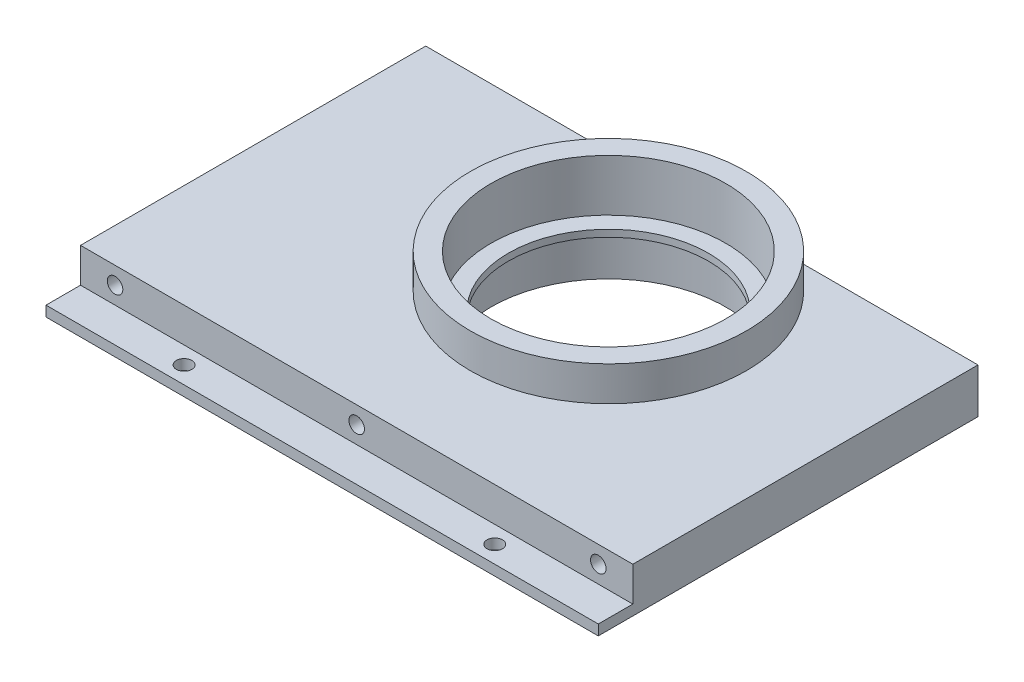
ISO-10303-21;
HEADER;
FILE_DESCRIPTION(('STEP AP214'),'2;1');
FILE_NAME('part.step','',(''),(''),'','','');
FILE_SCHEMA(('AUTOMOTIVE_DESIGN { 1 0 10303 214 1 1 1 1 }'));
ENDSEC;
DATA;
#1=APPLICATION_CONTEXT('core data for automotive mechanical design processes');
#2=APPLICATION_PROTOCOL_DEFINITION('international standard','automotive_design',2000,#1);
#3=PRODUCT_CONTEXT('',#1,'mechanical');
#4=PRODUCT('Part','Part','',(#3));
#5=PRODUCT_RELATED_PRODUCT_CATEGORY('part','',(#4));
#6=PRODUCT_DEFINITION_FORMATION('','',#4);
#7=PRODUCT_DEFINITION_CONTEXT('part definition',#1,'design');
#8=PRODUCT_DEFINITION('design','',#6,#7);
#9=PRODUCT_DEFINITION_SHAPE('','',#8);
#10=(LENGTH_UNIT() NAMED_UNIT(*) SI_UNIT(.MILLI.,.METRE.));
#11=(NAMED_UNIT(*) PLANE_ANGLE_UNIT() SI_UNIT($,.RADIAN.));
#12=(NAMED_UNIT(*) SI_UNIT($,.STERADIAN.) SOLID_ANGLE_UNIT());
#13=UNCERTAINTY_MEASURE_WITH_UNIT(LENGTH_MEASURE(1.E-05),#10,'distance_accuracy_value','');
#14=(GEOMETRIC_REPRESENTATION_CONTEXT(3) GLOBAL_UNCERTAINTY_ASSIGNED_CONTEXT((#13)) GLOBAL_UNIT_ASSIGNED_CONTEXT((#10,
#11,#12)) REPRESENTATION_CONTEXT('',''));
#15=CARTESIAN_POINT('',(0.,0.,0.));
#16=DIRECTION('',(0.,0.,1.));
#17=DIRECTION('',(1.,0.,0.));
#18=AXIS2_PLACEMENT_3D('',#15,#16,#17);
#19=CARTESIAN_POINT('',(0.,15.,0.));
#20=DIRECTION('',(0.,-1.,0.));
#21=DIRECTION('',(0.,0.,-1.));
#22=AXIS2_PLACEMENT_3D('',#19,#20,#21);
#23=CYLINDRICAL_SURFACE('',#22,40.);
#24=CARTESIAN_POINT('',(0.,-16.,0.));
#25=DIRECTION('',(0.,1.,0.));
#26=DIRECTION('',(0.,0.,1.));
#27=AXIS2_PLACEMENT_3D('',#24,#25,#26);
#28=CIRCLE('',#27,40.);
#29=CARTESIAN_POINT('',(0.,-16.,40.));
#30=VERTEX_POINT('',#29);
#31=EDGE_CURVE('E208',#30,#30,#28,.T.);
#32=ORIENTED_EDGE('',*,*,#31,.T.);
#33=EDGE_LOOP('',(#32));
#34=FACE_BOUND('',#33,.T.);
#35=CARTESIAN_POINT('',(0.,15.,0.));
#36=DIRECTION('',(0.,1.,0.));
#37=DIRECTION('',(0.,0.,1.));
#38=AXIS2_PLACEMENT_3D('',#35,#36,#37);
#39=CIRCLE('',#38,40.);
#40=CARTESIAN_POINT('',(0.,15.,40.));
#41=VERTEX_POINT('',#40);
#42=EDGE_CURVE('E47',#41,#41,#39,.T.);
#43=ORIENTED_EDGE('',*,*,#42,.F.);
#44=EDGE_LOOP('',(#43));
#45=FACE_BOUND('',#44,.T.);
#46=CARTESIAN_POINT('',(0.,-8.,0.));
#47=DIRECTION('',(0.,1.,0.));
#48=DIRECTION('',(0.,0.,1.));
#49=AXIS2_PLACEMENT_3D('',#46,#47,#48);
#50=CIRCLE('',#49,40.);
#51=CARTESIAN_POINT('',(-19.3649167310371,-8.,-35.));
#52=VERTEX_POINT('',#51);
#53=CARTESIAN_POINT('',(19.3649167310371,-8.,-35.));
#54=VERTEX_POINT('',#53);
#55=EDGE_CURVE('E135',#52,#54,#50,.T.);
#56=ORIENTED_EDGE('',*,*,#55,.F.);
#57=DIRECTION('',(0.,1.,0.));
#58=VECTOR('',#57,1.);
#59=CARTESIAN_POINT('',(-19.3649167310371,-5.,-35.));
#60=LINE('',#59,#58);
#61=CARTESIAN_POINT('',(-19.3649167310371,5.,-35.));
#62=VERTEX_POINT('',#61);
#63=EDGE_CURVE('E62',#52,#62,#60,.T.);
#64=ORIENTED_EDGE('',*,*,#63,.T.);
#65=CARTESIAN_POINT('',(0.,5.,0.));
#66=DIRECTION('',(0.,1.,0.));
#67=DIRECTION('',(0.,0.,1.));
#68=AXIS2_PLACEMENT_3D('',#65,#66,#67);
#69=CIRCLE('',#68,40.);
#70=CARTESIAN_POINT('',(19.3649167310371,5.,-35.));
#71=VERTEX_POINT('',#70);
#72=EDGE_CURVE('E165',#62,#71,#69,.T.);
#73=ORIENTED_EDGE('',*,*,#72,.T.);
#74=DIRECTION('',(0.,1.,0.));
#75=VECTOR('',#74,1.);
#76=CARTESIAN_POINT('',(19.3649167310371,-5.,-35.));
#77=LINE('',#76,#75);
#78=EDGE_CURVE('E54',#54,#71,#77,.T.);
#79=ORIENTED_EDGE('',*,*,#78,.F.);
#80=EDGE_LOOP('',(#56,#64,#73,#79));
#81=FACE_BOUND('',#80,.T.);
#82=ADVANCED_FACE('F39',(#34,#45,#81),#23,.T.);
#83=CARTESIAN_POINT('',(0.,15.,0.));
#84=DIRECTION('',(0.,-1.,0.));
#85=DIRECTION('',(0.,0.,-1.));
#86=AXIS2_PLACEMENT_3D('',#83,#84,#85);
#87=CYLINDRICAL_SURFACE('',#86,34.);
#88=CARTESIAN_POINT('',(0.,-16.,0.));
#89=DIRECTION('',(0.,1.,0.));
#90=DIRECTION('',(0.,0.,1.));
#91=AXIS2_PLACEMENT_3D('',#88,#89,#90);
#92=CIRCLE('',#91,34.);
#93=CARTESIAN_POINT('',(0.,-16.,34.));
#94=VERTEX_POINT('',#93);
#95=EDGE_CURVE('E203',#94,#94,#92,.T.);
#96=ORIENTED_EDGE('',*,*,#95,.F.);
#97=EDGE_LOOP('',(#96));
#98=FACE_BOUND('',#97,.T.);
#99=CARTESIAN_POINT('',(0.,-2.,0.));
#100=DIRECTION('',(0.,1.,0.));
#101=DIRECTION('',(0.,0.,1.));
#102=AXIS2_PLACEMENT_3D('',#99,#100,#101);
#103=CIRCLE('',#102,34.);
#104=CARTESIAN_POINT('',(0.,-2.,34.));
#105=VERTEX_POINT('',#104);
#106=EDGE_CURVE('E200',#105,#105,#103,.T.);
#107=ORIENTED_EDGE('',*,*,#106,.T.);
#108=EDGE_LOOP('',(#107));
#109=FACE_BOUND('',#108,.T.);
#110=ADVANCED_FACE('F219',(#98,#109),#87,.F.);
#111=CARTESIAN_POINT('',(0.,0.,0.));
#112=DIRECTION('',(0.,1.,0.));
#113=DIRECTION('',(0.,0.,1.));
#114=AXIS2_PLACEMENT_3D('',#111,#112,#113);
#115=CIRCLE('',#114,34.);
#116=CARTESIAN_POINT('',(0.,0.,34.));
#117=VERTEX_POINT('',#116);
#118=EDGE_CURVE('E11',#117,#117,#115,.T.);
#119=ORIENTED_EDGE('',*,*,#118,.F.);
#120=EDGE_LOOP('',(#119));
#121=FACE_BOUND('',#120,.T.);
#122=CARTESIAN_POINT('',(0.,15.,0.));
#123=DIRECTION('',(0.,1.,0.));
#124=DIRECTION('',(0.,0.,1.));
#125=AXIS2_PLACEMENT_3D('',#122,#123,#124);
#126=CIRCLE('',#125,34.);
#127=CARTESIAN_POINT('',(0.,15.,34.));
#128=VERTEX_POINT('',#127);
#129=EDGE_CURVE('E211',#128,#128,#126,.T.);
#130=ORIENTED_EDGE('',*,*,#129,.T.);
#131=EDGE_LOOP('',(#130));
#132=FACE_BOUND('',#131,.T.);
#133=ADVANCED_FACE('F41',(#121,#132),#87,.F.);
#134=CARTESIAN_POINT('',(0.,15.,0.));
#135=DIRECTION('',(0.,1.,0.));
#136=DIRECTION('',(0.,0.,1.));
#137=AXIS2_PLACEMENT_3D('',#134,#135,#136);
#138=PLANE('',#137);
#139=ORIENTED_EDGE('',*,*,#129,.F.);
#140=EDGE_LOOP('',(#139));
#141=FACE_BOUND('',#140,.T.);
#142=ORIENTED_EDGE('',*,*,#42,.T.);
#143=EDGE_LOOP('',(#142));
#144=FACE_BOUND('',#143,.T.);
#145=ADVANCED_FACE('F216',(#141,#144),#138,.T.);
#146=CARTESIAN_POINT('',(0.,-16.,0.));
#147=DIRECTION('',(0.,1.,0.));
#148=DIRECTION('',(0.,0.,1.));
#149=AXIS2_PLACEMENT_3D('',#146,#147,#148);
#150=PLANE('',#149);
#151=ORIENTED_EDGE('',*,*,#95,.T.);
#152=EDGE_LOOP('',(#151));
#153=FACE_BOUND('',#152,.T.);
#154=ORIENTED_EDGE('',*,*,#31,.F.);
#155=EDGE_LOOP('',(#154));
#156=FACE_BOUND('',#155,.T.);
#157=ADVANCED_FACE('F264',(#153,#156),#150,.F.);
#158=CARTESIAN_POINT('',(0.,-2.,0.));
#159=DIRECTION('',(0.,1.,0.));
#160=DIRECTION('',(0.,0.,1.));
#161=AXIS2_PLACEMENT_3D('',#158,#159,#160);
#162=CYLINDRICAL_SURFACE('',#161,29.);
#163=CARTESIAN_POINT('',(0.,-2.,0.));
#164=DIRECTION('',(0.,1.,0.));
#165=DIRECTION('',(0.,0.,1.));
#166=AXIS2_PLACEMENT_3D('',#163,#164,#165);
#167=CIRCLE('',#166,29.);
#168=CARTESIAN_POINT('',(0.,-2.,29.));
#169=VERTEX_POINT('',#168);
#170=EDGE_CURVE('E197',#169,#169,#167,.T.);
#171=ORIENTED_EDGE('',*,*,#170,.F.);
#172=EDGE_LOOP('',(#171));
#173=FACE_BOUND('',#172,.T.);
#174=CARTESIAN_POINT('',(0.,0.,0.));
#175=DIRECTION('',(0.,1.,0.));
#176=DIRECTION('',(0.,0.,1.));
#177=AXIS2_PLACEMENT_3D('',#174,#175,#176);
#178=CIRCLE('',#177,29.);
#179=CARTESIAN_POINT('',(0.,0.,29.));
#180=VERTEX_POINT('',#179);
#181=EDGE_CURVE('E187',#180,#180,#178,.T.);
#182=ORIENTED_EDGE('',*,*,#181,.T.);
#183=EDGE_LOOP('',(#182));
#184=FACE_BOUND('',#183,.T.);
#185=ADVANCED_FACE('F257',(#173,#184),#162,.F.);
#186=CARTESIAN_POINT('',(0.,-2.,0.));
#187=DIRECTION('',(0.,1.,0.));
#188=DIRECTION('',(0.,0.,1.));
#189=AXIS2_PLACEMENT_3D('',#186,#187,#188);
#190=PLANE('',#189);
#191=ORIENTED_EDGE('',*,*,#170,.T.);
#192=EDGE_LOOP('',(#191));
#193=FACE_BOUND('',#192,.T.);
#194=ORIENTED_EDGE('',*,*,#106,.F.);
#195=EDGE_LOOP('',(#194));
#196=FACE_BOUND('',#195,.T.);
#197=ADVANCED_FACE('F253',(#193,#196),#190,.F.);
#198=CARTESIAN_POINT('',(0.,0.,0.));
#199=DIRECTION('',(0.,1.,0.));
#200=DIRECTION('',(0.,0.,1.));
#201=AXIS2_PLACEMENT_3D('',#198,#199,#200);
#202=PLANE('',#201);
#203=ORIENTED_EDGE('',*,*,#181,.F.);
#204=EDGE_LOOP('',(#203));
#205=FACE_BOUND('',#204,.T.);
#206=ORIENTED_EDGE('',*,*,#118,.T.);
#207=EDGE_LOOP('',(#206));
#208=FACE_BOUND('',#207,.T.);
#209=ADVANCED_FACE('F256',(#205,#208),#202,.T.);
#210=CARTESIAN_POINT('',(0.,-5.,-35.));
#211=DIRECTION('',(0.,0.,1.));
#212=DIRECTION('',(1.,0.,0.));
#213=AXIS2_PLACEMENT_3D('',#210,#211,#212);
#214=PLANE('',#213);
#215=ORIENTED_EDGE('',*,*,#78,.T.);
#216=DIRECTION('',(1.,0.,0.));
#217=VECTOR('',#216,1.);
#218=CARTESIAN_POINT('',(0.,5.,-35.));
#219=LINE('',#218,#217);
#220=CARTESIAN_POINT('',(72.08,5.,-35.));
#221=VERTEX_POINT('',#220);
#222=EDGE_CURVE('E180',#71,#221,#219,.T.);
#223=ORIENTED_EDGE('',*,*,#222,.T.);
#224=DIRECTION('',(0.,1.,0.));
#225=VECTOR('',#224,1.);
#226=CARTESIAN_POINT('',(72.08,-5.,-35.));
#227=LINE('',#226,#225);
#228=CARTESIAN_POINT('',(72.08,-8.,-35.));
#229=VERTEX_POINT('',#228);
#230=EDGE_CURVE('E188',#229,#221,#227,.T.);
#231=ORIENTED_EDGE('',*,*,#230,.F.);
#232=DIRECTION('',(-1.,0.,0.));
#233=VECTOR('',#232,1.);
#234=CARTESIAN_POINT('',(0.,-8.,-34.9999999999999));
#235=LINE('',#234,#233);
#236=EDGE_CURVE('E133',#229,#54,#235,.T.);
#237=ORIENTED_EDGE('',*,*,#236,.T.);
#238=EDGE_LOOP('',(#215,#223,#231,#237));
#239=FACE_BOUND('',#238,.T.);
#240=ADVANCED_FACE('F233',(#239),#214,.F.);
#241=CARTESIAN_POINT('',(72.08,-5.,0.));
#242=DIRECTION('',(-1.,0.,0.));
#243=DIRECTION('',(0.,0.,1.));
#244=AXIS2_PLACEMENT_3D('',#241,#242,#243);
#245=PLANE('',#244);
#246=ORIENTED_EDGE('',*,*,#230,.T.);
#247=DIRECTION('',(0.,0.,1.));
#248=VECTOR('',#247,1.);
#249=CARTESIAN_POINT('',(72.08,5.,0.));
#250=LINE('',#249,#248);
#251=CARTESIAN_POINT('',(72.08,5.,65.));
#252=VERTEX_POINT('',#251);
#253=EDGE_CURVE('E177',#221,#252,#250,.T.);
#254=ORIENTED_EDGE('',*,*,#253,.T.);
#255=DIRECTION('',(0.,1.,0.));
#256=VECTOR('',#255,1.);
#257=CARTESIAN_POINT('',(72.08,-5.,65.));
#258=LINE('',#257,#256);
#259=CARTESIAN_POINT('',(72.08,-5.,65.));
#260=VERTEX_POINT('',#259);
#261=EDGE_CURVE('E190',#260,#252,#258,.T.);
#262=ORIENTED_EDGE('',*,*,#261,.F.);
#263=DIRECTION('',(0.,0.,-1.));
#264=VECTOR('',#263,1.);
#265=CARTESIAN_POINT('',(72.08,-5.,0.));
#266=LINE('',#265,#264);
#267=CARTESIAN_POINT('',(72.08,-5.,75.));
#268=VERTEX_POINT('',#267);
#269=EDGE_CURVE('E126',#268,#260,#266,.T.);
#270=ORIENTED_EDGE('',*,*,#269,.F.);
#271=DIRECTION('',(0.,1.,0.));
#272=VECTOR('',#271,1.);
#273=CARTESIAN_POINT('',(72.08,-8.,75.));
#274=LINE('',#273,#272);
#275=CARTESIAN_POINT('',(72.08,-8.,75.));
#276=VERTEX_POINT('',#275);
#277=EDGE_CURVE('E110',#276,#268,#274,.T.);
#278=ORIENTED_EDGE('',*,*,#277,.F.);
#279=DIRECTION('',(0.,0.,-1.));
#280=VECTOR('',#279,1.);
#281=CARTESIAN_POINT('',(72.08,-8.,0.));
#282=LINE('',#281,#280);
#283=EDGE_CURVE('E118',#276,#229,#282,.T.);
#284=ORIENTED_EDGE('',*,*,#283,.T.);
#285=EDGE_LOOP('',(#246,#254,#262,#270,#278,#284));
#286=FACE_BOUND('',#285,.T.);
#287=ADVANCED_FACE('F123',(#286),#245,.F.);
#288=CARTESIAN_POINT('',(-1.80411241501588E-13,-5.,65.0000000000002));
#289=DIRECTION('',(0.,0.,-1.));
#290=DIRECTION('',(-1.,0.,0.));
#291=AXIS2_PLACEMENT_3D('',#288,#289,#290);
#292=PLANE('',#291);
#293=CARTESIAN_POINT('',(62.0799999999997,0.,65.0000000000002));
#294=DIRECTION('',(0.,0.,1.));
#295=DIRECTION('',(-1.,0.,0.));
#296=AXIS2_PLACEMENT_3D('',#293,#294,#295);
#297=CIRCLE('',#296,2.25);
#298=CARTESIAN_POINT('',(59.8299999999997,0.,65.0000000000002));
#299=VERTEX_POINT('',#298);
#300=EDGE_CURVE('E148',#299,#299,#297,.T.);
#301=ORIENTED_EDGE('',*,*,#300,.F.);
#302=EDGE_LOOP('',(#301));
#303=FACE_BOUND('',#302,.T.);
#304=CARTESIAN_POINT('',(-77.9209924354783,0.,65.0000000000002));
#305=DIRECTION('',(0.,0.,1.));
#306=DIRECTION('',(1.,0.,0.));
#307=AXIS2_PLACEMENT_3D('',#304,#305,#306);
#308=CIRCLE('',#307,2.25);
#309=CARTESIAN_POINT('',(-75.6709924354783,0.,65.0000000000002));
#310=VERTEX_POINT('',#309);
#311=EDGE_CURVE('E154',#310,#310,#308,.T.);
#312=ORIENTED_EDGE('',*,*,#311,.F.);
#313=EDGE_LOOP('',(#312));
#314=FACE_BOUND('',#313,.T.);
#315=CARTESIAN_POINT('',(-7.92049621773916,0.,65.0000000000002));
#316=DIRECTION('',(0.,0.,1.));
#317=DIRECTION('',(1.,0.,0.));
#318=AXIS2_PLACEMENT_3D('',#315,#316,#317);
#319=CIRCLE('',#318,2.25);
#320=CARTESIAN_POINT('',(-5.67049621773916,0.,65.0000000000002));
#321=VERTEX_POINT('',#320);
#322=EDGE_CURVE('E153',#321,#321,#319,.T.);
#323=ORIENTED_EDGE('',*,*,#322,.F.);
#324=EDGE_LOOP('',(#323));
#325=FACE_BOUND('',#324,.T.);
#326=ORIENTED_EDGE('',*,*,#261,.T.);
#327=DIRECTION('',(-1.,0.,0.));
#328=VECTOR('',#327,1.);
#329=CARTESIAN_POINT('',(-1.80411241501588E-13,5.,65.0000000000002));
#330=LINE('',#329,#328);
#331=CARTESIAN_POINT('',(-87.9209924354783,5.,65.));
#332=VERTEX_POINT('',#331);
#333=EDGE_CURVE('E174',#252,#332,#330,.T.);
#334=ORIENTED_EDGE('',*,*,#333,.T.);
#335=DIRECTION('',(0.,1.,0.));
#336=VECTOR('',#335,1.);
#337=CARTESIAN_POINT('',(-87.9209924354783,-5.,65.));
#338=LINE('',#337,#336);
#339=CARTESIAN_POINT('',(-87.9209924354783,-5.,65.));
#340=VERTEX_POINT('',#339);
#341=EDGE_CURVE('E192',#340,#332,#338,.T.);
#342=ORIENTED_EDGE('',*,*,#341,.F.);
#343=DIRECTION('',(-1.,0.,0.));
#344=VECTOR('',#343,1.);
#345=CARTESIAN_POINT('',(-1.80411241501588E-13,-5.,65.0000000000002));
#346=LINE('',#345,#344);
#347=EDGE_CURVE('E183',#260,#340,#346,.T.);
#348=ORIENTED_EDGE('',*,*,#347,.F.);
#349=EDGE_LOOP('',(#326,#334,#342,#348));
#350=FACE_BOUND('',#349,.T.);
#351=ADVANCED_FACE('F237',(#303,#314,#325,#350),#292,.F.);
#352=CARTESIAN_POINT('',(-87.9209924354783,-5.,0.));
#353=DIRECTION('',(-1.,0.,0.));
#354=DIRECTION('',(0.,0.,1.));
#355=AXIS2_PLACEMENT_3D('',#352,#353,#354);
#356=PLANE('',#355);
#357=ORIENTED_EDGE('',*,*,#341,.T.);
#358=DIRECTION('',(0.,0.,1.));
#359=VECTOR('',#358,1.);
#360=CARTESIAN_POINT('',(-87.9209924354783,5.,0.));
#361=LINE('',#360,#359);
#362=CARTESIAN_POINT('',(-87.9209924354783,5.,-35.));
#363=VERTEX_POINT('',#362);
#364=EDGE_CURVE('E171',#363,#332,#361,.T.);
#365=ORIENTED_EDGE('',*,*,#364,.F.);
#366=DIRECTION('',(0.,1.,0.));
#367=VECTOR('',#366,1.);
#368=CARTESIAN_POINT('',(-87.9209924354783,-5.,-35.));
#369=LINE('',#368,#367);
#370=CARTESIAN_POINT('',(-87.9209924354783,-8.,-35.));
#371=VERTEX_POINT('',#370);
#372=EDGE_CURVE('E194',#371,#363,#369,.T.);
#373=ORIENTED_EDGE('',*,*,#372,.F.);
#374=DIRECTION('',(0.,0.,1.));
#375=VECTOR('',#374,1.);
#376=CARTESIAN_POINT('',(-87.9209924354783,-8.,0.));
#377=LINE('',#376,#375);
#378=CARTESIAN_POINT('',(-87.9209924354783,-8.,75.));
#379=VERTEX_POINT('',#378);
#380=EDGE_CURVE('E128',#371,#379,#377,.T.);
#381=ORIENTED_EDGE('',*,*,#380,.T.);
#382=DIRECTION('',(0.,1.,0.));
#383=VECTOR('',#382,1.);
#384=CARTESIAN_POINT('',(-87.9209924354783,-8.,75.));
#385=LINE('',#384,#383);
#386=CARTESIAN_POINT('',(-87.9209924354783,-5.,75.));
#387=VERTEX_POINT('',#386);
#388=EDGE_CURVE('E113',#379,#387,#385,.T.);
#389=ORIENTED_EDGE('',*,*,#388,.T.);
#390=DIRECTION('',(0.,0.,1.));
#391=VECTOR('',#390,1.);
#392=CARTESIAN_POINT('',(-87.9209924354783,-5.,0.));
#393=LINE('',#392,#391);
#394=EDGE_CURVE('E119',#340,#387,#393,.T.);
#395=ORIENTED_EDGE('',*,*,#394,.F.);
#396=EDGE_LOOP('',(#357,#365,#373,#381,#389,#395));
#397=FACE_BOUND('',#396,.T.);
#398=ADVANCED_FACE('F226',(#397),#356,.T.);
#399=CARTESIAN_POINT('',(0.,-5.,-35.));
#400=DIRECTION('',(0.,0.,1.));
#401=DIRECTION('',(1.,0.,0.));
#402=AXIS2_PLACEMENT_3D('',#399,#400,#401);
#403=PLANE('',#402);
#404=ORIENTED_EDGE('',*,*,#372,.T.);
#405=DIRECTION('',(1.,0.,0.));
#406=VECTOR('',#405,1.);
#407=CARTESIAN_POINT('',(0.,5.,-35.));
#408=LINE('',#407,#406);
#409=EDGE_CURVE('E169',#363,#62,#408,.T.);
#410=ORIENTED_EDGE('',*,*,#409,.T.);
#411=ORIENTED_EDGE('',*,*,#63,.F.);
#412=DIRECTION('',(-1.,0.,0.));
#413=VECTOR('',#412,1.);
#414=CARTESIAN_POINT('',(0.,-8.,-35.));
#415=LINE('',#414,#413);
#416=EDGE_CURVE('E140',#52,#371,#415,.T.);
#417=ORIENTED_EDGE('',*,*,#416,.T.);
#418=EDGE_LOOP('',(#404,#410,#411,#417));
#419=FACE_BOUND('',#418,.T.);
#420=ADVANCED_FACE('F222',(#419),#403,.F.);
#421=CARTESIAN_POINT('',(0.,5.,0.));
#422=DIRECTION('',(0.,1.,0.));
#423=DIRECTION('',(0.,0.,1.));
#424=AXIS2_PLACEMENT_3D('',#421,#422,#423);
#425=PLANE('',#424);
#426=ORIENTED_EDGE('',*,*,#72,.F.);
#427=ORIENTED_EDGE('',*,*,#409,.F.);
#428=ORIENTED_EDGE('',*,*,#364,.T.);
#429=ORIENTED_EDGE('',*,*,#333,.F.);
#430=ORIENTED_EDGE('',*,*,#253,.F.);
#431=ORIENTED_EDGE('',*,*,#222,.F.);
#432=EDGE_LOOP('',(#426,#427,#428,#429,#430,#431));
#433=FACE_BOUND('',#432,.T.);
#434=ADVANCED_FACE('F230',(#433),#425,.T.);
#435=CARTESIAN_POINT('',(-7.92049621773916,0.,55.0000000000002));
#436=DIRECTION('',(0.,0.,1.));
#437=DIRECTION('',(1.,0.,0.));
#438=AXIS2_PLACEMENT_3D('',#435,#436,#437);
#439=CYLINDRICAL_SURFACE('',#438,2.25);
#440=CARTESIAN_POINT('',(-7.92049621773916,0.,55.0000000000002));
#441=DIRECTION('',(0.,0.,1.));
#442=DIRECTION('',(1.,0.,0.));
#443=AXIS2_PLACEMENT_3D('',#440,#441,#442);
#444=CIRCLE('',#443,2.25);
#445=CARTESIAN_POINT('',(-5.67049621773916,0.,55.0000000000002));
#446=VERTEX_POINT('',#445);
#447=EDGE_CURVE('E162',#446,#446,#444,.T.);
#448=ORIENTED_EDGE('',*,*,#447,.F.);
#449=EDGE_LOOP('',(#448));
#450=FACE_BOUND('',#449,.T.);
#451=ORIENTED_EDGE('',*,*,#322,.T.);
#452=EDGE_LOOP('',(#451));
#453=FACE_BOUND('',#452,.T.);
#454=ADVANCED_FACE('F411',(#450,#453),#439,.F.);
#455=CARTESIAN_POINT('',(-7.92049621773916,0.,55.0000000000002));
#456=DIRECTION('',(0.,0.,1.));
#457=DIRECTION('',(1.,0.,0.));
#458=AXIS2_PLACEMENT_3D('',#455,#456,#457);
#459=PLANE('',#458);
#460=ORIENTED_EDGE('',*,*,#447,.T.);
#461=EDGE_LOOP('',(#460));
#462=FACE_BOUND('',#461,.T.);
#463=ADVANCED_FACE('F402',(#462),#459,.T.);
#464=CARTESIAN_POINT('',(-77.9209924354783,0.,55.0000000000002));
#465=DIRECTION('',(0.,0.,1.));
#466=DIRECTION('',(1.,0.,0.));
#467=AXIS2_PLACEMENT_3D('',#464,#465,#466);
#468=CYLINDRICAL_SURFACE('',#467,2.25);
#469=CARTESIAN_POINT('',(-77.9209924354783,0.,55.0000000000002));
#470=DIRECTION('',(0.,0.,1.));
#471=DIRECTION('',(1.,0.,0.));
#472=AXIS2_PLACEMENT_3D('',#469,#470,#471);
#473=CIRCLE('',#472,2.25);
#474=CARTESIAN_POINT('',(-75.6709924354783,0.,55.0000000000002));
#475=VERTEX_POINT('',#474);
#476=EDGE_CURVE('E150',#475,#475,#473,.T.);
#477=ORIENTED_EDGE('',*,*,#476,.F.);
#478=EDGE_LOOP('',(#477));
#479=FACE_BOUND('',#478,.T.);
#480=ORIENTED_EDGE('',*,*,#311,.T.);
#481=EDGE_LOOP('',(#480));
#482=FACE_BOUND('',#481,.T.);
#483=ADVANCED_FACE('F398',(#479,#482),#468,.F.);
#484=CARTESIAN_POINT('',(-77.9209924354783,0.,55.0000000000002));
#485=DIRECTION('',(0.,0.,1.));
#486=DIRECTION('',(1.,0.,0.));
#487=AXIS2_PLACEMENT_3D('',#484,#485,#486);
#488=PLANE('',#487);
#489=ORIENTED_EDGE('',*,*,#476,.T.);
#490=EDGE_LOOP('',(#489));
#491=FACE_BOUND('',#490,.T.);
#492=ADVANCED_FACE('F394',(#491),#488,.T.);
#493=CARTESIAN_POINT('',(62.0799999999997,0.,55.0000000000002));
#494=DIRECTION('',(0.,0.,1.));
#495=DIRECTION('',(1.,0.,0.));
#496=AXIS2_PLACEMENT_3D('',#493,#494,#495);
#497=CYLINDRICAL_SURFACE('',#496,2.25);
#498=CARTESIAN_POINT('',(62.0799999999997,0.,55.0000000000002));
#499=DIRECTION('',(0.,0.,1.));
#500=DIRECTION('',(-1.,0.,0.));
#501=AXIS2_PLACEMENT_3D('',#498,#499,#500);
#502=CIRCLE('',#501,2.25);
#503=CARTESIAN_POINT('',(59.8299999999997,0.,55.0000000000002));
#504=VERTEX_POINT('',#503);
#505=EDGE_CURVE('E157',#504,#504,#502,.T.);
#506=ORIENTED_EDGE('',*,*,#505,.F.);
#507=EDGE_LOOP('',(#506));
#508=FACE_BOUND('',#507,.T.);
#509=ORIENTED_EDGE('',*,*,#300,.T.);
#510=EDGE_LOOP('',(#509));
#511=FACE_BOUND('',#510,.T.);
#512=ADVANCED_FACE('F397',(#508,#511),#497,.F.);
#513=CARTESIAN_POINT('',(62.0799999999997,0.,55.0000000000002));
#514=DIRECTION('',(0.,0.,-1.));
#515=DIRECTION('',(-1.,0.,0.));
#516=AXIS2_PLACEMENT_3D('',#513,#514,#515);
#517=PLANE('',#516);
#518=ORIENTED_EDGE('',*,*,#505,.T.);
#519=EDGE_LOOP('',(#518));
#520=FACE_BOUND('',#519,.T.);
#521=ADVANCED_FACE('F304',(#520),#517,.F.);
#522=CARTESIAN_POINT('',(0.,-5.,0.));
#523=DIRECTION('',(0.,1.,0.));
#524=DIRECTION('',(0.,0.,1.));
#525=AXIS2_PLACEMENT_3D('',#522,#523,#524);
#526=PLANE('',#525);
#527=CARTESIAN_POINT('',(-52.9209924354783,-5.,70.));
#528=DIRECTION('',(0.,1.,0.));
#529=DIRECTION('',(0.,0.,1.));
#530=AXIS2_PLACEMENT_3D('',#527,#528,#529);
#531=CIRCLE('',#530,2.25);
#532=CARTESIAN_POINT('',(-52.9209924354783,-5.,72.2500000000001));
#533=VERTEX_POINT('',#532);
#534=EDGE_CURVE('E531',#533,#533,#531,.T.);
#535=ORIENTED_EDGE('',*,*,#534,.F.);
#536=EDGE_LOOP('',(#535));
#537=FACE_BOUND('',#536,.T.);
#538=CARTESIAN_POINT('',(37.08,-5.,70.));
#539=DIRECTION('',(0.,1.,0.));
#540=DIRECTION('',(0.,0.,-1.));
#541=AXIS2_PLACEMENT_3D('',#538,#539,#540);
#542=CIRCLE('',#541,2.25000000000001);
#543=CARTESIAN_POINT('',(37.08,-5.,67.75));
#544=VERTEX_POINT('',#543);
#545=EDGE_CURVE('E536',#544,#544,#542,.T.);
#546=ORIENTED_EDGE('',*,*,#545,.F.);
#547=EDGE_LOOP('',(#546));
#548=FACE_BOUND('',#547,.T.);
#549=ORIENTED_EDGE('',*,*,#347,.T.);
#550=ORIENTED_EDGE('',*,*,#394,.T.);
#551=DIRECTION('',(1.,0.,0.));
#552=VECTOR('',#551,1.);
#553=CARTESIAN_POINT('',(0.,-5.,75.));
#554=LINE('',#553,#552);
#555=EDGE_CURVE('E143',#387,#268,#554,.T.);
#556=ORIENTED_EDGE('',*,*,#555,.T.);
#557=ORIENTED_EDGE('',*,*,#269,.T.);
#558=EDGE_LOOP('',(#549,#550,#556,#557));
#559=FACE_BOUND('',#558,.T.);
#560=ADVANCED_FACE('F236',(#537,#548,#559),#526,.T.);
#561=CARTESIAN_POINT('',(0.,-8.,75.));
#562=DIRECTION('',(0.,0.,1.));
#563=DIRECTION('',(1.,0.,0.));
#564=AXIS2_PLACEMENT_3D('',#561,#562,#563);
#565=PLANE('',#564);
#566=ORIENTED_EDGE('',*,*,#555,.F.);
#567=ORIENTED_EDGE('',*,*,#388,.F.);
#568=DIRECTION('',(1.,0.,0.));
#569=VECTOR('',#568,1.);
#570=CARTESIAN_POINT('',(0.,-8.,75.));
#571=LINE('',#570,#569);
#572=EDGE_CURVE('E106',#379,#276,#571,.T.);
#573=ORIENTED_EDGE('',*,*,#572,.T.);
#574=ORIENTED_EDGE('',*,*,#277,.T.);
#575=EDGE_LOOP('',(#566,#567,#573,#574));
#576=FACE_BOUND('',#575,.T.);
#577=ADVANCED_FACE('F109',(#576),#565,.T.);
#578=CARTESIAN_POINT('',(0.,-8.,0.));
#579=DIRECTION('',(0.,1.,0.));
#580=DIRECTION('',(0.,0.,1.));
#581=AXIS2_PLACEMENT_3D('',#578,#579,#580);
#582=PLANE('',#581);
#583=CARTESIAN_POINT('',(-52.9209924354783,-8.,70.));
#584=DIRECTION('',(0.,1.,0.));
#585=DIRECTION('',(0.,0.,1.));
#586=AXIS2_PLACEMENT_3D('',#583,#584,#585);
#587=CIRCLE('',#586,2.25);
#588=CARTESIAN_POINT('',(-52.9209924354783,-8.,72.2500000000001));
#589=VERTEX_POINT('',#588);
#590=EDGE_CURVE('E145',#589,#589,#587,.T.);
#591=ORIENTED_EDGE('',*,*,#590,.T.);
#592=EDGE_LOOP('',(#591));
#593=FACE_BOUND('',#592,.T.);
#594=CARTESIAN_POINT('',(37.08,-8.,70.));
#595=DIRECTION('',(0.,1.,0.));
#596=DIRECTION('',(0.,0.,-1.));
#597=AXIS2_PLACEMENT_3D('',#594,#595,#596);
#598=CIRCLE('',#597,2.25000000000001);
#599=CARTESIAN_POINT('',(37.08,-8.,67.75));
#600=VERTEX_POINT('',#599);
#601=EDGE_CURVE('E532',#600,#600,#598,.T.);
#602=ORIENTED_EDGE('',*,*,#601,.T.);
#603=EDGE_LOOP('',(#602));
#604=FACE_BOUND('',#603,.T.);
#605=ORIENTED_EDGE('',*,*,#572,.F.);
#606=ORIENTED_EDGE('',*,*,#380,.F.);
#607=ORIENTED_EDGE('',*,*,#416,.F.);
#608=ORIENTED_EDGE('',*,*,#55,.T.);
#609=ORIENTED_EDGE('',*,*,#236,.F.);
#610=ORIENTED_EDGE('',*,*,#283,.F.);
#611=EDGE_LOOP('',(#605,#606,#607,#608,#609,#610));
#612=FACE_BOUND('',#611,.T.);
#613=ADVANCED_FACE('F131',(#593,#604,#612),#582,.F.);
#614=CARTESIAN_POINT('',(37.08,-8.,70.));
#615=DIRECTION('',(0.,1.,0.));
#616=DIRECTION('',(0.,0.,1.));
#617=AXIS2_PLACEMENT_3D('',#614,#615,#616);
#618=CYLINDRICAL_SURFACE('',#617,2.25000000000001);
#619=ORIENTED_EDGE('',*,*,#601,.F.);
#620=EDGE_LOOP('',(#619));
#621=FACE_BOUND('',#620,.T.);
#622=ORIENTED_EDGE('',*,*,#545,.T.);
#623=EDGE_LOOP('',(#622));
#624=FACE_BOUND('',#623,.T.);
#625=ADVANCED_FACE('F367',(#621,#624),#618,.F.);
#626=CARTESIAN_POINT('',(-52.9209924354783,-8.,70.));
#627=DIRECTION('',(0.,1.,0.));
#628=DIRECTION('',(0.,0.,1.));
#629=AXIS2_PLACEMENT_3D('',#626,#627,#628);
#630=CYLINDRICAL_SURFACE('',#629,2.25);
#631=ORIENTED_EDGE('',*,*,#590,.F.);
#632=EDGE_LOOP('',(#631));
#633=FACE_BOUND('',#632,.T.);
#634=ORIENTED_EDGE('',*,*,#534,.T.);
#635=EDGE_LOOP('',(#634));
#636=FACE_BOUND('',#635,.T.);
#637=ADVANCED_FACE('F377',(#633,#636),#630,.F.);
#638=CLOSED_SHELL('',(#82,#110,#133,#145,#157,#185,#197,#209,#240,#287,#351,#398,#420,#434,#454,
#463,#483,#492,#512,#521,#560,#577,#613,#625,#637));
#639=MANIFOLD_SOLID_BREP('B2',#638);
#640=ADVANCED_BREP_SHAPE_REPRESENTATION('',(#18,#639),#14);
#641=SHAPE_DEFINITION_REPRESENTATION(#9,#640);
ENDSEC;
END-ISO-10303-21;
